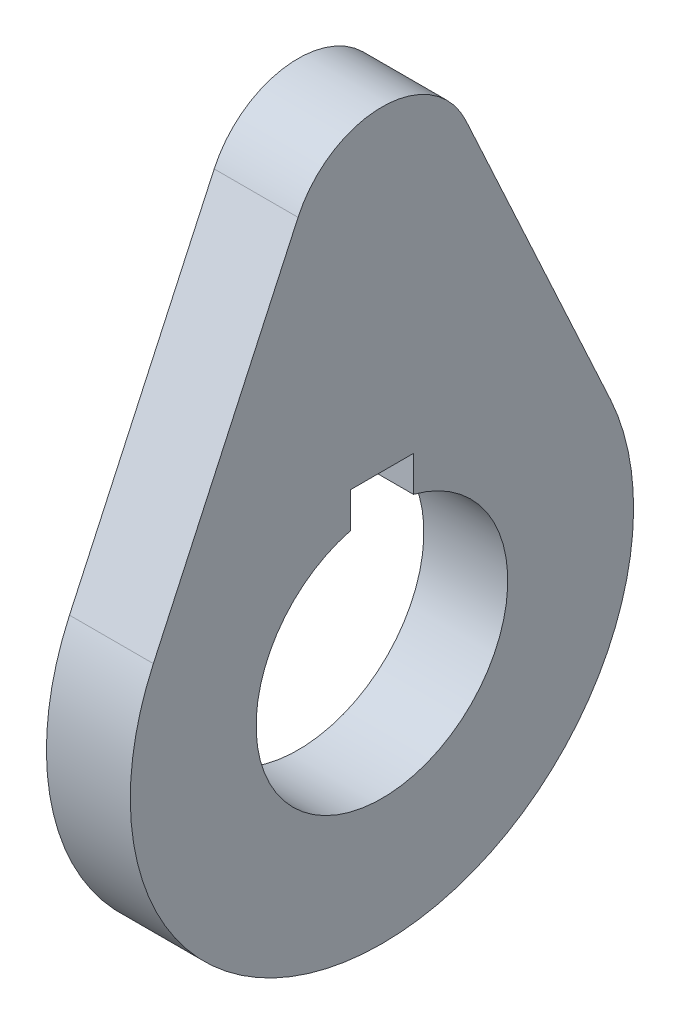
ISO-10303-21;
HEADER;
FILE_DESCRIPTION(('STEP AP214'),'2;1');
FILE_NAME('part.step','',(''),(''),'','','');
FILE_SCHEMA(('AUTOMOTIVE_DESIGN { 1 0 10303 214 1 1 1 1 }'));
ENDSEC;
DATA;
#1=APPLICATION_CONTEXT('core data for automotive mechanical design processes');
#2=APPLICATION_PROTOCOL_DEFINITION('international standard','automotive_design',2000,#1);
#3=PRODUCT_CONTEXT('',#1,'mechanical');
#4=PRODUCT('Part','Part','',(#3));
#5=PRODUCT_RELATED_PRODUCT_CATEGORY('part','',(#4));
#6=PRODUCT_DEFINITION_FORMATION('','',#4);
#7=PRODUCT_DEFINITION_CONTEXT('part definition',#1,'design');
#8=PRODUCT_DEFINITION('design','',#6,#7);
#9=PRODUCT_DEFINITION_SHAPE('','',#8);
#10=(LENGTH_UNIT() NAMED_UNIT(*) SI_UNIT(.MILLI.,.METRE.));
#11=(NAMED_UNIT(*) PLANE_ANGLE_UNIT() SI_UNIT($,.RADIAN.));
#12=(NAMED_UNIT(*) SI_UNIT($,.STERADIAN.) SOLID_ANGLE_UNIT());
#13=UNCERTAINTY_MEASURE_WITH_UNIT(LENGTH_MEASURE(1.E-05),#10,'distance_accuracy_value','');
#14=(GEOMETRIC_REPRESENTATION_CONTEXT(3) GLOBAL_UNCERTAINTY_ASSIGNED_CONTEXT((#13)) GLOBAL_UNIT_ASSIGNED_CONTEXT((#10,
#11,#12)) REPRESENTATION_CONTEXT('',''));
#15=CARTESIAN_POINT('',(0.,0.,0.));
#16=DIRECTION('',(0.,0.,1.));
#17=DIRECTION('',(1.,0.,0.));
#18=AXIS2_PLACEMENT_3D('',#15,#16,#17);
#19=CARTESIAN_POINT('',(12.7,0.,0.));
#20=DIRECTION('',(1.,0.,0.));
#21=DIRECTION('',(0.,0.,-1.));
#22=AXIS2_PLACEMENT_3D('',#19,#20,#21);
#23=PLANE('',#22);
#24=DIRECTION('',(0.,-1.,0.));
#25=VECTOR('',#24,1.);
#26=CARTESIAN_POINT('',(12.7,23.8125,4.7625));
#27=LINE('',#26,#25);
#28=CARTESIAN_POINT('',(12.7,23.8125,4.7625));
#29=VERTEX_POINT('',#28);
#30=CARTESIAN_POINT('',(12.7,18.4450831863128,4.7625));
#31=VERTEX_POINT('',#30);
#32=EDGE_CURVE('E130',#29,#31,#27,.T.);
#33=ORIENTED_EDGE('',*,*,#32,.F.);
#34=DIRECTION('',(0.,0.,1.));
#35=VECTOR('',#34,1.);
#36=CARTESIAN_POINT('',(12.7,23.8125,4.7625));
#37=LINE('',#36,#35);
#38=CARTESIAN_POINT('',(12.7,23.8125,-4.7625));
#39=VERTEX_POINT('',#38);
#40=EDGE_CURVE('E135',#39,#29,#37,.T.);
#41=ORIENTED_EDGE('',*,*,#40,.F.);
#42=DIRECTION('',(0.,1.,0.));
#43=VECTOR('',#42,1.);
#44=CARTESIAN_POINT('',(12.7,23.8125,-4.7625));
#45=LINE('',#44,#43);
#46=CARTESIAN_POINT('',(12.7,18.4450831863128,-4.7625));
#47=VERTEX_POINT('',#46);
#48=EDGE_CURVE('E143',#47,#39,#45,.T.);
#49=ORIENTED_EDGE('',*,*,#48,.F.);
#50=CARTESIAN_POINT('',(12.7,0.,0.));
#51=DIRECTION('',(1.,0.,0.));
#52=DIRECTION('',(0.,0.,-1.));
#53=AXIS2_PLACEMENT_3D('',#50,#51,#52);
#54=CIRCLE('',#53,19.05);
#55=EDGE_CURVE('E152',#31,#47,#54,.T.);
#56=ORIENTED_EDGE('',*,*,#55,.F.);
#57=EDGE_LOOP('',(#33,#41,#49,#56));
#58=FACE_BOUND('',#57,.T.);
#59=CARTESIAN_POINT('',(12.7,0.,0.));
#60=DIRECTION('',(1.,0.,0.));
#61=DIRECTION('',(0.,0.,-1.));
#62=AXIS2_PLACEMENT_3D('',#59,#60,#61);
#63=CIRCLE('',#62,38.1);
#64=CARTESIAN_POINT('',(12.7,15.9388336793834,34.6058316030832));
#65=VERTEX_POINT('',#64);
#66=CARTESIAN_POINT('',(12.7,15.9388336793834,-34.6058316030832));
#67=VERTEX_POINT('',#66);
#68=EDGE_CURVE('E53',#65,#67,#63,.T.);
#69=ORIENTED_EDGE('',*,*,#68,.T.);
#70=DIRECTION('',(0.,0.908289543388012,0.418342091322398));
#71=VECTOR('',#70,1.);
#72=CARTESIAN_POINT('',(12.7,63.5,-12.7));
#73=LINE('',#72,#71);
#74=CARTESIAN_POINT('',(12.7,63.5,-12.7));
#75=VERTEX_POINT('',#74);
#76=EDGE_CURVE('E102',#67,#75,#73,.T.);
#77=ORIENTED_EDGE('',*,*,#76,.T.);
#78=CARTESIAN_POINT('',(12.7,57.6506047289979,0.));
#79=DIRECTION('',(1.,0.,0.));
#80=DIRECTION('',(0.,0.,1.));
#81=AXIS2_PLACEMENT_3D('',#78,#79,#80);
#82=CIRCLE('',#81,13.9823254516701);
#83=CARTESIAN_POINT('',(12.7,63.5,12.7));
#84=VERTEX_POINT('',#83);
#85=EDGE_CURVE('E110',#75,#84,#82,.T.);
#86=ORIENTED_EDGE('',*,*,#85,.T.);
#87=DIRECTION('',(0.,-0.908289543388012,0.418342091322398));
#88=VECTOR('',#87,1.);
#89=CARTESIAN_POINT('',(12.7,15.9388336793834,34.6058316030832));
#90=LINE('',#89,#88);
#91=EDGE_CURVE('E116',#84,#65,#90,.T.);
#92=ORIENTED_EDGE('',*,*,#91,.T.);
#93=EDGE_LOOP('',(#69,#77,#86,#92));
#94=FACE_BOUND('',#93,.T.);
#95=ADVANCED_FACE('F33',(#58,#94),#23,.T.);
#96=CARTESIAN_POINT('',(0.,0.,0.));
#97=DIRECTION('',(1.,0.,0.));
#98=DIRECTION('',(0.,0.,-1.));
#99=AXIS2_PLACEMENT_3D('',#96,#97,#98);
#100=PLANE('',#99);
#101=CARTESIAN_POINT('',(0.,0.,0.));
#102=DIRECTION('',(1.,0.,0.));
#103=DIRECTION('',(0.,0.,-1.));
#104=AXIS2_PLACEMENT_3D('',#101,#102,#103);
#105=CIRCLE('',#104,38.1);
#106=CARTESIAN_POINT('',(0.,15.9388336793834,34.6058316030832));
#107=VERTEX_POINT('',#106);
#108=CARTESIAN_POINT('',(0.,15.9388336793833,-34.6058316030832));
#109=VERTEX_POINT('',#108);
#110=EDGE_CURVE('E48',#107,#109,#105,.T.);
#111=ORIENTED_EDGE('',*,*,#110,.F.);
#112=DIRECTION('',(0.,0.908289543388012,-0.418342091322398));
#113=VECTOR('',#112,1.);
#114=CARTESIAN_POINT('',(0.,15.9388336793834,34.6058316030832));
#115=LINE('',#114,#113);
#116=CARTESIAN_POINT('',(0.,63.5,12.7));
#117=VERTEX_POINT('',#116);
#118=EDGE_CURVE('E120',#107,#117,#115,.T.);
#119=ORIENTED_EDGE('',*,*,#118,.T.);
#120=CARTESIAN_POINT('',(0.,57.6506047289979,0.));
#121=DIRECTION('',(1.,0.,0.));
#122=DIRECTION('',(0.,0.,-1.));
#123=AXIS2_PLACEMENT_3D('',#120,#121,#122);
#124=CIRCLE('',#123,13.9823254516701);
#125=CARTESIAN_POINT('',(0.,63.5,-12.7));
#126=VERTEX_POINT('',#125);
#127=EDGE_CURVE('E126',#117,#126,#124,.F.);
#128=ORIENTED_EDGE('',*,*,#127,.T.);
#129=DIRECTION('',(0.,-0.908289543388012,-0.418342091322398));
#130=VECTOR('',#129,1.);
#131=CARTESIAN_POINT('',(0.,63.5,-12.7));
#132=LINE('',#131,#130);
#133=EDGE_CURVE('E103',#126,#109,#132,.T.);
#134=ORIENTED_EDGE('',*,*,#133,.T.);
#135=EDGE_LOOP('',(#111,#119,#128,#134));
#136=FACE_BOUND('',#135,.T.);
#137=DIRECTION('',(0.,0.,1.));
#138=VECTOR('',#137,1.);
#139=CARTESIAN_POINT('',(0.,23.8125,4.7625));
#140=LINE('',#139,#138);
#141=CARTESIAN_POINT('',(0.,23.8125,-4.7625));
#142=VERTEX_POINT('',#141);
#143=CARTESIAN_POINT('',(0.,23.8125,4.7625));
#144=VERTEX_POINT('',#143);
#145=EDGE_CURVE('E138',#142,#144,#140,.T.);
#146=ORIENTED_EDGE('',*,*,#145,.T.);
#147=DIRECTION('',(0.,-1.,0.));
#148=VECTOR('',#147,1.);
#149=CARTESIAN_POINT('',(0.,23.8125,4.7625));
#150=LINE('',#149,#148);
#151=CARTESIAN_POINT('',(0.,18.4450831863128,4.7625));
#152=VERTEX_POINT('',#151);
#153=EDGE_CURVE('E131',#144,#152,#150,.T.);
#154=ORIENTED_EDGE('',*,*,#153,.T.);
#155=CARTESIAN_POINT('',(0.,0.,0.));
#156=DIRECTION('',(1.,0.,0.));
#157=DIRECTION('',(0.,0.,-1.));
#158=AXIS2_PLACEMENT_3D('',#155,#156,#157);
#159=CIRCLE('',#158,19.05);
#160=CARTESIAN_POINT('',(0.,18.4450831863128,-4.7625));
#161=VERTEX_POINT('',#160);
#162=EDGE_CURVE('E149',#152,#161,#159,.T.);
#163=ORIENTED_EDGE('',*,*,#162,.T.);
#164=DIRECTION('',(0.,1.,0.));
#165=VECTOR('',#164,1.);
#166=CARTESIAN_POINT('',(0.,23.8125,-4.7625));
#167=LINE('',#166,#165);
#168=EDGE_CURVE('E134',#161,#142,#167,.T.);
#169=ORIENTED_EDGE('',*,*,#168,.T.);
#170=EDGE_LOOP('',(#146,#154,#163,#169));
#171=FACE_BOUND('',#170,.T.);
#172=ADVANCED_FACE('F174',(#136,#171),#100,.F.);
#173=CARTESIAN_POINT('',(12.7,0.,0.));
#174=DIRECTION('',(-1.,0.,0.));
#175=DIRECTION('',(0.,0.,1.));
#176=AXIS2_PLACEMENT_3D('',#173,#174,#175);
#177=CYLINDRICAL_SURFACE('',#176,38.1);
#178=ORIENTED_EDGE('',*,*,#68,.F.);
#179=DIRECTION('',(1.,0.,0.));
#180=VECTOR('',#179,1.);
#181=CARTESIAN_POINT('',(-88.8374172793099,15.9388336793834,34.6058316030832));
#182=LINE('',#181,#180);
#183=EDGE_CURVE('E124',#107,#65,#182,.T.);
#184=ORIENTED_EDGE('',*,*,#183,.F.);
#185=ORIENTED_EDGE('',*,*,#110,.T.);
#186=DIRECTION('',(1.,0.,0.));
#187=VECTOR('',#186,1.);
#188=CARTESIAN_POINT('',(-88.8374172793099,15.9388336793834,-34.6058316030832));
#189=LINE('',#188,#187);
#190=EDGE_CURVE('E107',#109,#67,#189,.T.);
#191=ORIENTED_EDGE('',*,*,#190,.T.);
#192=EDGE_LOOP('',(#178,#184,#185,#191));
#193=FACE_BOUND('',#192,.T.);
#194=ADVANCED_FACE('F35',(#193),#177,.T.);
#195=CARTESIAN_POINT('',(12.7,0.,0.));
#196=DIRECTION('',(-1.,0.,0.));
#197=DIRECTION('',(0.,0.,1.));
#198=AXIS2_PLACEMENT_3D('',#195,#196,#197);
#199=CYLINDRICAL_SURFACE('',#198,19.05);
#200=DIRECTION('',(-1.,0.,0.));
#201=VECTOR('',#200,1.);
#202=CARTESIAN_POINT('',(12.7,18.4450831863128,4.7625));
#203=LINE('',#202,#201);
#204=EDGE_CURVE('E11',#31,#152,#203,.T.);
#205=ORIENTED_EDGE('',*,*,#204,.F.);
#206=ORIENTED_EDGE('',*,*,#55,.T.);
#207=DIRECTION('',(-1.,0.,0.));
#208=VECTOR('',#207,1.);
#209=CARTESIAN_POINT('',(12.7,18.4450831863128,-4.7625));
#210=LINE('',#209,#208);
#211=EDGE_CURVE('E41',#161,#47,#210,.F.);
#212=ORIENTED_EDGE('',*,*,#211,.F.);
#213=ORIENTED_EDGE('',*,*,#162,.F.);
#214=EDGE_LOOP('',(#205,#206,#212,#213));
#215=FACE_BOUND('',#214,.T.);
#216=ADVANCED_FACE('F169',(#215),#199,.F.);
#217=CARTESIAN_POINT('',(0.,23.8125,4.7625));
#218=DIRECTION('',(0.,0.,1.));
#219=DIRECTION('',(0.,-1.,0.));
#220=AXIS2_PLACEMENT_3D('',#217,#218,#219);
#221=PLANE('',#220);
#222=ORIENTED_EDGE('',*,*,#204,.T.);
#223=ORIENTED_EDGE('',*,*,#153,.F.);
#224=DIRECTION('',(1.,0.,0.));
#225=VECTOR('',#224,1.);
#226=CARTESIAN_POINT('',(0.,23.8125,4.7625));
#227=LINE('',#226,#225);
#228=EDGE_CURVE('E147',#144,#29,#227,.T.);
#229=ORIENTED_EDGE('',*,*,#228,.T.);
#230=ORIENTED_EDGE('',*,*,#32,.T.);
#231=EDGE_LOOP('',(#222,#223,#229,#230));
#232=FACE_BOUND('',#231,.T.);
#233=ADVANCED_FACE('F172',(#232),#221,.F.);
#234=CARTESIAN_POINT('',(0.,23.8125,4.7625));
#235=DIRECTION('',(0.,1.,0.));
#236=DIRECTION('',(0.,0.,1.));
#237=AXIS2_PLACEMENT_3D('',#234,#235,#236);
#238=PLANE('',#237);
#239=ORIENTED_EDGE('',*,*,#40,.T.);
#240=ORIENTED_EDGE('',*,*,#228,.F.);
#241=ORIENTED_EDGE('',*,*,#145,.F.);
#242=DIRECTION('',(1.,0.,0.));
#243=VECTOR('',#242,1.);
#244=CARTESIAN_POINT('',(0.,23.8125,-4.7625));
#245=LINE('',#244,#243);
#246=EDGE_CURVE('E141',#142,#39,#245,.T.);
#247=ORIENTED_EDGE('',*,*,#246,.T.);
#248=EDGE_LOOP('',(#239,#240,#241,#247));
#249=FACE_BOUND('',#248,.T.);
#250=ADVANCED_FACE('F177',(#249),#238,.F.);
#251=CARTESIAN_POINT('',(0.,23.8125,-4.7625));
#252=DIRECTION('',(0.,0.,-1.));
#253=DIRECTION('',(0.,1.,0.));
#254=AXIS2_PLACEMENT_3D('',#251,#252,#253);
#255=PLANE('',#254);
#256=ORIENTED_EDGE('',*,*,#211,.T.);
#257=ORIENTED_EDGE('',*,*,#48,.T.);
#258=ORIENTED_EDGE('',*,*,#246,.F.);
#259=ORIENTED_EDGE('',*,*,#168,.F.);
#260=EDGE_LOOP('',(#256,#257,#258,#259));
#261=FACE_BOUND('',#260,.T.);
#262=ADVANCED_FACE('F161',(#261),#255,.F.);
#263=CARTESIAN_POINT('',(-88.8374172793099,15.9388336793834,34.6058316030832));
#264=DIRECTION('',(0.,0.418342091322398,0.908289543388012));
#265=DIRECTION('',(0.,-0.908289543388012,0.418342091322398));
#266=AXIS2_PLACEMENT_3D('',#263,#264,#265);
#267=PLANE('',#266);
#268=ORIENTED_EDGE('',*,*,#118,.F.);
#269=ORIENTED_EDGE('',*,*,#183,.T.);
#270=ORIENTED_EDGE('',*,*,#91,.F.);
#271=DIRECTION('',(1.,0.,0.));
#272=VECTOR('',#271,1.);
#273=CARTESIAN_POINT('',(-88.8374172793099,63.5,12.7));
#274=LINE('',#273,#272);
#275=EDGE_CURVE('E106',#117,#84,#274,.T.);
#276=ORIENTED_EDGE('',*,*,#275,.F.);
#277=EDGE_LOOP('',(#268,#269,#270,#276));
#278=FACE_BOUND('',#277,.T.);
#279=ADVANCED_FACE('F184',(#278),#267,.T.);
#280=CARTESIAN_POINT('',(-88.8374172793099,57.6506047289979,0.));
#281=DIRECTION('',(1.,0.,0.));
#282=DIRECTION('',(0.,0.,-1.));
#283=AXIS2_PLACEMENT_3D('',#280,#281,#282);
#284=CYLINDRICAL_SURFACE('',#283,13.9823254516701);
#285=ORIENTED_EDGE('',*,*,#127,.F.);
#286=ORIENTED_EDGE('',*,*,#275,.T.);
#287=ORIENTED_EDGE('',*,*,#85,.F.);
#288=DIRECTION('',(1.,0.,0.));
#289=VECTOR('',#288,1.);
#290=CARTESIAN_POINT('',(-88.8374172793099,63.5,-12.7));
#291=LINE('',#290,#289);
#292=EDGE_CURVE('E97',#126,#75,#291,.T.);
#293=ORIENTED_EDGE('',*,*,#292,.F.);
#294=EDGE_LOOP('',(#285,#286,#287,#293));
#295=FACE_BOUND('',#294,.T.);
#296=ADVANCED_FACE('F111',(#295),#284,.T.);
#297=CARTESIAN_POINT('',(-88.8374172793099,63.5,-12.7));
#298=DIRECTION('',(0.,0.418342091322398,-0.908289543388012));
#299=DIRECTION('',(0.,0.908289543388012,0.418342091322398));
#300=AXIS2_PLACEMENT_3D('',#297,#298,#299);
#301=PLANE('',#300);
#302=ORIENTED_EDGE('',*,*,#133,.F.);
#303=ORIENTED_EDGE('',*,*,#292,.T.);
#304=ORIENTED_EDGE('',*,*,#76,.F.);
#305=ORIENTED_EDGE('',*,*,#190,.F.);
#306=EDGE_LOOP('',(#302,#303,#304,#305));
#307=FACE_BOUND('',#306,.T.);
#308=ADVANCED_FACE('F99',(#307),#301,.T.);
#309=CLOSED_SHELL('',(#95,#172,#194,#216,#233,#250,#262,#279,#296,#308));
#310=MANIFOLD_SOLID_BREP('B2',#309);
#311=ADVANCED_BREP_SHAPE_REPRESENTATION('',(#18,#310),#14);
#312=SHAPE_DEFINITION_REPRESENTATION(#9,#311);
ENDSEC;
END-ISO-10303-21;
